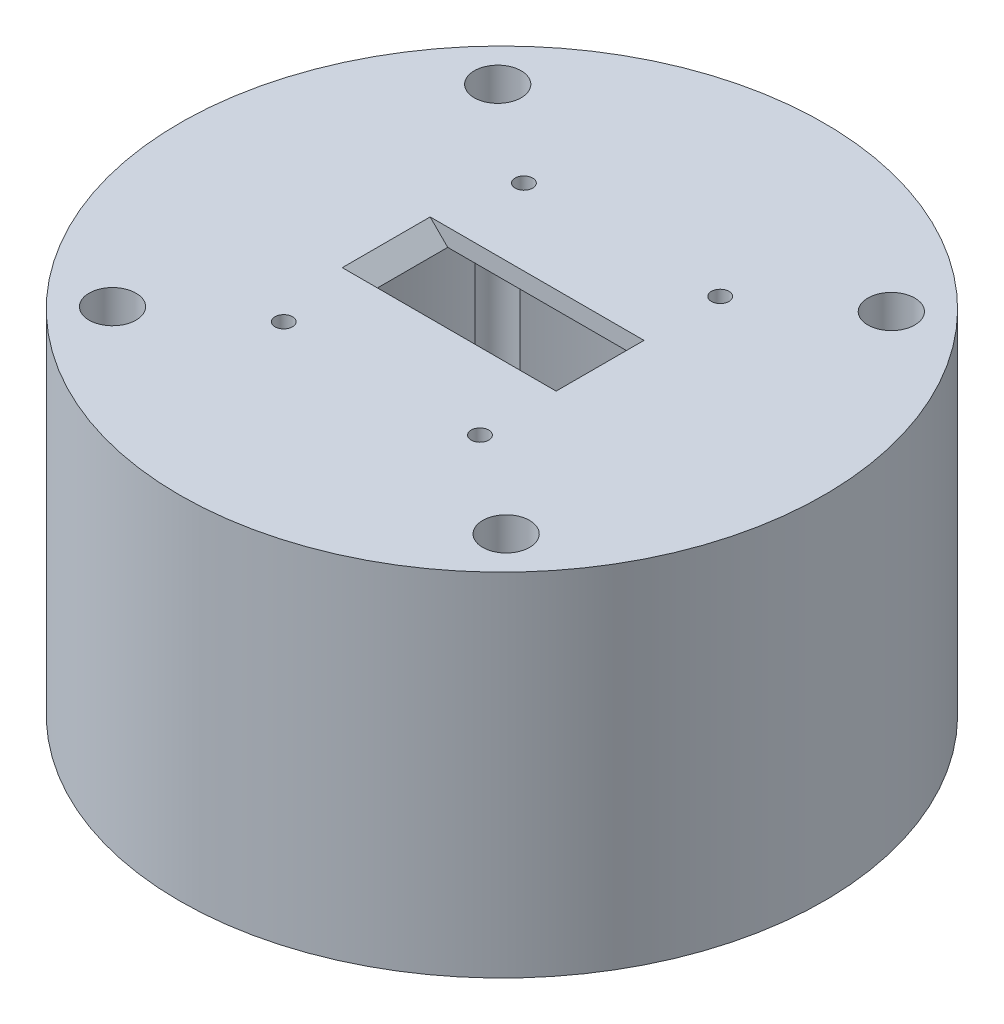
ISO-10303-21;
HEADER;
FILE_DESCRIPTION(('STEP AP214'),'2;1');
FILE_NAME('part.step','',(''),(''),'','','');
FILE_SCHEMA(('AUTOMOTIVE_DESIGN { 1 0 10303 214 1 1 1 1 }'));
ENDSEC;
DATA;
#1=APPLICATION_CONTEXT('core data for automotive mechanical design processes');
#2=APPLICATION_PROTOCOL_DEFINITION('international standard','automotive_design',2000,#1);
#3=PRODUCT_CONTEXT('',#1,'mechanical');
#4=PRODUCT('Part','Part','',(#3));
#5=PRODUCT_RELATED_PRODUCT_CATEGORY('part','',(#4));
#6=PRODUCT_DEFINITION_FORMATION('','',#4);
#7=PRODUCT_DEFINITION_CONTEXT('part definition',#1,'design');
#8=PRODUCT_DEFINITION('design','',#6,#7);
#9=PRODUCT_DEFINITION_SHAPE('','',#8);
#10=(LENGTH_UNIT() NAMED_UNIT(*) SI_UNIT(.MILLI.,.METRE.));
#11=(NAMED_UNIT(*) PLANE_ANGLE_UNIT() SI_UNIT($,.RADIAN.));
#12=(NAMED_UNIT(*) SI_UNIT($,.STERADIAN.) SOLID_ANGLE_UNIT());
#13=UNCERTAINTY_MEASURE_WITH_UNIT(LENGTH_MEASURE(1.E-05),#10,'distance_accuracy_value','');
#14=(GEOMETRIC_REPRESENTATION_CONTEXT(3) GLOBAL_UNCERTAINTY_ASSIGNED_CONTEXT((#13)) GLOBAL_UNIT_ASSIGNED_CONTEXT((#10,
#11,#12)) REPRESENTATION_CONTEXT('',''));
#15=CARTESIAN_POINT('',(0.,0.,0.));
#16=DIRECTION('',(0.,0.,1.));
#17=DIRECTION('',(1.,0.,0.));
#18=AXIS2_PLACEMENT_3D('',#15,#16,#17);
#19=CARTESIAN_POINT('',(16.75,60.,-7.5));
#20=DIRECTION('',(1.,0.,0.));
#21=DIRECTION('',(0.,0.,-1.));
#22=AXIS2_PLACEMENT_3D('',#19,#20,#21);
#23=PLANE('',#22);
#24=DIRECTION('',(0.,0.,-1.));
#25=VECTOR('',#24,1.);
#26=CARTESIAN_POINT('',(16.75,57.,-7.5));
#27=LINE('',#26,#25);
#28=CARTESIAN_POINT('',(16.75,57.,7.5));
#29=VERTEX_POINT('',#28);
#30=CARTESIAN_POINT('',(16.75,57.,-7.5));
#31=VERTEX_POINT('',#30);
#32=EDGE_CURVE('E276',#29,#31,#27,.T.);
#33=ORIENTED_EDGE('',*,*,#32,.F.);
#34=DIRECTION('',(0.,-1.,0.));
#35=VECTOR('',#34,1.);
#36=CARTESIAN_POINT('',(16.75,60.,7.5));
#37=LINE('',#36,#35);
#38=CARTESIAN_POINT('',(16.75,60.,7.5));
#39=VERTEX_POINT('',#38);
#40=EDGE_CURVE('E342',#39,#29,#37,.T.);
#41=ORIENTED_EDGE('',*,*,#40,.F.);
#42=DIRECTION('',(0.,0.,1.));
#43=VECTOR('',#42,1.);
#44=CARTESIAN_POINT('',(16.75,60.,-7.5));
#45=LINE('',#44,#43);
#46=CARTESIAN_POINT('',(16.75,60.,-7.5));
#47=VERTEX_POINT('',#46);
#48=EDGE_CURVE('E338',#47,#39,#45,.T.);
#49=ORIENTED_EDGE('',*,*,#48,.F.);
#50=DIRECTION('',(0.,-1.,0.));
#51=VECTOR('',#50,1.);
#52=CARTESIAN_POINT('',(16.75,60.,-7.5));
#53=LINE('',#52,#51);
#54=EDGE_CURVE('E343',#47,#31,#53,.T.);
#55=ORIENTED_EDGE('',*,*,#54,.T.);
#56=EDGE_LOOP('',(#33,#41,#49,#55));
#57=FACE_BOUND('',#56,.T.);
#58=ADVANCED_FACE('F46',(#57),#23,.F.);
#59=CARTESIAN_POINT('',(-16.75,60.,-7.5));
#60=DIRECTION('',(0.,0.,-1.));
#61=DIRECTION('',(-1.,0.,0.));
#62=AXIS2_PLACEMENT_3D('',#59,#60,#61);
#63=PLANE('',#62);
#64=DIRECTION('',(-1.,0.,0.));
#65=VECTOR('',#64,1.);
#66=CARTESIAN_POINT('',(-16.75,57.,-7.5));
#67=LINE('',#66,#65);
#68=CARTESIAN_POINT('',(-16.75,57.,-7.5));
#69=VERTEX_POINT('',#68);
#70=EDGE_CURVE('E273',#31,#69,#67,.T.);
#71=ORIENTED_EDGE('',*,*,#70,.F.);
#72=ORIENTED_EDGE('',*,*,#54,.F.);
#73=DIRECTION('',(1.,0.,0.));
#74=VECTOR('',#73,1.);
#75=CARTESIAN_POINT('',(-16.75,60.,-7.5));
#76=LINE('',#75,#74);
#77=CARTESIAN_POINT('',(-19.75,60.,-7.5));
#78=VERTEX_POINT('',#77);
#79=EDGE_CURVE('E61',#78,#47,#76,.T.);
#80=ORIENTED_EDGE('',*,*,#79,.F.);
#81=DIRECTION('',(0.707106781186546,-0.707106781186549,0.));
#82=VECTOR('',#81,1.);
#83=CARTESIAN_POINT('',(-18.25,58.5,-7.5));
#84=LINE('',#83,#82);
#85=EDGE_CURVE('E54',#78,#69,#84,.T.);
#86=ORIENTED_EDGE('',*,*,#85,.T.);
#87=EDGE_LOOP('',(#71,#72,#80,#86));
#88=FACE_BOUND('',#87,.T.);
#89=ADVANCED_FACE('F376',(#88),#63,.F.);
#90=CARTESIAN_POINT('',(-16.75,60.,7.5));
#91=DIRECTION('',(0.,0.,1.));
#92=DIRECTION('',(1.,0.,0.));
#93=AXIS2_PLACEMENT_3D('',#90,#91,#92);
#94=PLANE('',#93);
#95=DIRECTION('',(1.,0.,0.));
#96=VECTOR('',#95,1.);
#97=CARTESIAN_POINT('',(-16.75,57.,7.5));
#98=LINE('',#97,#96);
#99=CARTESIAN_POINT('',(-16.75,57.,7.5));
#100=VERTEX_POINT('',#99);
#101=EDGE_CURVE('E269',#100,#29,#98,.T.);
#102=ORIENTED_EDGE('',*,*,#101,.F.);
#103=DIRECTION('',(-0.707106781186546,0.707106781186549,0.));
#104=VECTOR('',#103,1.);
#105=CARTESIAN_POINT('',(-18.25,58.5,7.5));
#106=LINE('',#105,#104);
#107=CARTESIAN_POINT('',(-19.75,60.,7.5));
#108=VERTEX_POINT('',#107);
#109=EDGE_CURVE('E13',#100,#108,#106,.T.);
#110=ORIENTED_EDGE('',*,*,#109,.T.);
#111=DIRECTION('',(-1.,0.,0.));
#112=VECTOR('',#111,1.);
#113=CARTESIAN_POINT('',(-16.75,60.,7.5));
#114=LINE('',#113,#112);
#115=EDGE_CURVE('E69',#39,#108,#114,.T.);
#116=ORIENTED_EDGE('',*,*,#115,.F.);
#117=ORIENTED_EDGE('',*,*,#40,.T.);
#118=EDGE_LOOP('',(#102,#110,#116,#117));
#119=FACE_BOUND('',#118,.T.);
#120=ADVANCED_FACE('F384',(#119),#94,.F.);
#121=CARTESIAN_POINT('',(-16.75,0.,-20.5));
#122=DIRECTION('',(0.,1.,0.));
#123=DIRECTION('',(0.,0.,1.));
#124=AXIS2_PLACEMENT_3D('',#121,#122,#123);
#125=CYLINDRICAL_SURFACE('',#124,1.5);
#126=CARTESIAN_POINT('',(-16.75,60.,-20.5));
#127=DIRECTION('',(0.,1.,0.));
#128=DIRECTION('',(0.,0.,1.));
#129=AXIS2_PLACEMENT_3D('',#126,#127,#128);
#130=CIRCLE('',#129,1.5);
#131=CARTESIAN_POINT('',(-16.75,60.,-19.));
#132=VERTEX_POINT('',#131);
#133=EDGE_CURVE('E335',#132,#132,#130,.T.);
#134=ORIENTED_EDGE('',*,*,#133,.T.);
#135=EDGE_LOOP('',(#134));
#136=FACE_BOUND('',#135,.T.);
#137=CARTESIAN_POINT('',(-16.75,57.,-20.5));
#138=DIRECTION('',(0.,-1.,0.));
#139=DIRECTION('',(0.,0.,-1.));
#140=AXIS2_PLACEMENT_3D('',#137,#138,#139);
#141=CIRCLE('',#140,1.5);
#142=CARTESIAN_POINT('',(-16.75,57.,-22.));
#143=VERTEX_POINT('',#142);
#144=EDGE_CURVE('E266',#143,#143,#141,.F.);
#145=ORIENTED_EDGE('',*,*,#144,.F.);
#146=EDGE_LOOP('',(#145));
#147=FACE_BOUND('',#146,.T.);
#148=ADVANCED_FACE('F473',(#136,#147),#125,.F.);
#149=CARTESIAN_POINT('',(16.75,0.,-20.5));
#150=DIRECTION('',(0.,1.,0.));
#151=DIRECTION('',(0.,0.,1.));
#152=AXIS2_PLACEMENT_3D('',#149,#150,#151);
#153=CYLINDRICAL_SURFACE('',#152,1.5);
#154=CARTESIAN_POINT('',(16.75,60.,-20.5));
#155=DIRECTION('',(0.,1.,0.));
#156=DIRECTION('',(0.,0.,1.));
#157=AXIS2_PLACEMENT_3D('',#154,#155,#156);
#158=CIRCLE('',#157,1.5);
#159=CARTESIAN_POINT('',(16.75,60.,-19.));
#160=VERTEX_POINT('',#159);
#161=EDGE_CURVE('E303',#160,#160,#158,.T.);
#162=ORIENTED_EDGE('',*,*,#161,.T.);
#163=EDGE_LOOP('',(#162));
#164=FACE_BOUND('',#163,.T.);
#165=CARTESIAN_POINT('',(16.75,57.,-20.5));
#166=DIRECTION('',(0.,-1.,0.));
#167=DIRECTION('',(0.,0.,-1.));
#168=AXIS2_PLACEMENT_3D('',#165,#166,#167);
#169=CIRCLE('',#168,1.5);
#170=CARTESIAN_POINT('',(16.75,57.,-22.));
#171=VERTEX_POINT('',#170);
#172=EDGE_CURVE('E263',#171,#171,#169,.F.);
#173=ORIENTED_EDGE('',*,*,#172,.F.);
#174=EDGE_LOOP('',(#173));
#175=FACE_BOUND('',#174,.T.);
#176=ADVANCED_FACE('F469',(#164,#175),#153,.F.);
#177=CARTESIAN_POINT('',(-16.75,0.,20.5));
#178=DIRECTION('',(0.,1.,0.));
#179=DIRECTION('',(0.,0.,1.));
#180=AXIS2_PLACEMENT_3D('',#177,#178,#179);
#181=CYLINDRICAL_SURFACE('',#180,1.5);
#182=CARTESIAN_POINT('',(-16.75,60.,20.5));
#183=DIRECTION('',(0.,1.,0.));
#184=DIRECTION('',(0.,0.,1.));
#185=AXIS2_PLACEMENT_3D('',#182,#183,#184);
#186=CIRCLE('',#185,1.5);
#187=CARTESIAN_POINT('',(-16.75,60.,22.));
#188=VERTEX_POINT('',#187);
#189=EDGE_CURVE('E307',#188,#188,#186,.T.);
#190=ORIENTED_EDGE('',*,*,#189,.T.);
#191=EDGE_LOOP('',(#190));
#192=FACE_BOUND('',#191,.T.);
#193=CARTESIAN_POINT('',(-16.75,57.,20.5));
#194=DIRECTION('',(0.,-1.,0.));
#195=DIRECTION('',(0.,0.,-1.));
#196=AXIS2_PLACEMENT_3D('',#193,#194,#195);
#197=CIRCLE('',#196,1.5);
#198=CARTESIAN_POINT('',(-16.75,57.,19.));
#199=VERTEX_POINT('',#198);
#200=EDGE_CURVE('E260',#199,#199,#197,.F.);
#201=ORIENTED_EDGE('',*,*,#200,.F.);
#202=EDGE_LOOP('',(#201));
#203=FACE_BOUND('',#202,.T.);
#204=ADVANCED_FACE('F472',(#192,#203),#181,.F.);
#205=CARTESIAN_POINT('',(16.75,0.,20.5));
#206=DIRECTION('',(0.,1.,0.));
#207=DIRECTION('',(0.,0.,1.));
#208=AXIS2_PLACEMENT_3D('',#205,#206,#207);
#209=CYLINDRICAL_SURFACE('',#208,1.5);
#210=CARTESIAN_POINT('',(16.75,60.,20.5));
#211=DIRECTION('',(0.,1.,0.));
#212=DIRECTION('',(0.,0.,1.));
#213=AXIS2_PLACEMENT_3D('',#210,#211,#212);
#214=CIRCLE('',#213,1.5);
#215=CARTESIAN_POINT('',(16.75,60.,22.));
#216=VERTEX_POINT('',#215);
#217=EDGE_CURVE('E282',#216,#216,#214,.T.);
#218=ORIENTED_EDGE('',*,*,#217,.T.);
#219=EDGE_LOOP('',(#218));
#220=FACE_BOUND('',#219,.T.);
#221=CARTESIAN_POINT('',(16.75,57.,20.5));
#222=DIRECTION('',(0.,-1.,0.));
#223=DIRECTION('',(0.,0.,-1.));
#224=AXIS2_PLACEMENT_3D('',#221,#222,#223);
#225=CIRCLE('',#224,1.5);
#226=CARTESIAN_POINT('',(16.75,57.,19.));
#227=VERTEX_POINT('',#226);
#228=EDGE_CURVE('E248',#227,#227,#225,.F.);
#229=ORIENTED_EDGE('',*,*,#228,.F.);
#230=EDGE_LOOP('',(#229));
#231=FACE_BOUND('',#230,.T.);
#232=ADVANCED_FACE('F477',(#220,#231),#209,.F.);
#233=CARTESIAN_POINT('',(0.,50.,0.));
#234=DIRECTION('',(0.,-1.,0.));
#235=DIRECTION('',(0.,0.,-1.));
#236=AXIS2_PLACEMENT_3D('',#233,#234,#235);
#237=CYLINDRICAL_SURFACE('',#236,50.);
#238=CARTESIAN_POINT('',(0.,50.,0.));
#239=DIRECTION('',(0.,-1.,0.));
#240=DIRECTION('',(0.,0.,-1.));
#241=AXIS2_PLACEMENT_3D('',#238,#239,#240);
#242=CIRCLE('',#241,50.);
#243=CARTESIAN_POINT('',(37.590562846943,50.,-32.9689184664895));
#244=VERTEX_POINT('',#243);
#245=CARTESIAN_POINT('',(37.590562846943,50.,32.9689184664894));
#246=VERTEX_POINT('',#245);
#247=EDGE_CURVE('E354',#244,#246,#242,.T.);
#248=ORIENTED_EDGE('',*,*,#247,.F.);
#249=DIRECTION('',(0.,1.,0.));
#250=VECTOR('',#249,1.);
#251=CARTESIAN_POINT('',(37.5905628469429,30.,-32.9689184664895));
#252=LINE('',#251,#250);
#253=CARTESIAN_POINT('',(37.5905628469429,0.,-32.9689184664896));
#254=VERTEX_POINT('',#253);
#255=EDGE_CURVE('E332',#244,#254,#252,.F.);
#256=ORIENTED_EDGE('',*,*,#255,.T.);
#257=CARTESIAN_POINT('',(0.,0.,0.));
#258=DIRECTION('',(0.,-1.,0.));
#259=DIRECTION('',(0.,0.,-1.));
#260=AXIS2_PLACEMENT_3D('',#257,#258,#259);
#261=CIRCLE('',#260,50.);
#262=CARTESIAN_POINT('',(37.5905628469429,0.,32.9689184664895));
#263=VERTEX_POINT('',#262);
#264=EDGE_CURVE('E353',#254,#263,#261,.T.);
#265=ORIENTED_EDGE('',*,*,#264,.T.);
#266=DIRECTION('',(0.,1.,0.));
#267=VECTOR('',#266,1.);
#268=CARTESIAN_POINT('',(37.5905628469429,30.,32.9689184664894));
#269=LINE('',#268,#267);
#270=EDGE_CURVE('E306',#263,#246,#269,.T.);
#271=ORIENTED_EDGE('',*,*,#270,.T.);
#272=EDGE_LOOP('',(#248,#256,#265,#271));
#273=FACE_BOUND('',#272,.T.);
#274=ADVANCED_FACE('F411',(#273),#237,.F.);
#275=CARTESIAN_POINT('',(-33.7747495446768,0.,-36.868228777558));
#276=VERTEX_POINT('',#275);
#277=CARTESIAN_POINT('',(33.7747495446768,0.,-36.868228777558));
#278=VERTEX_POINT('',#277);
#279=EDGE_CURVE('E346',#276,#278,#261,.T.);
#280=ORIENTED_EDGE('',*,*,#279,.T.);
#281=DIRECTION('',(0.,1.,0.));
#282=VECTOR('',#281,1.);
#283=CARTESIAN_POINT('',(33.7747495446767,30.,-36.868228777558));
#284=LINE('',#283,#282);
#285=CARTESIAN_POINT('',(33.7747495446767,50.,-36.8682287775581));
#286=VERTEX_POINT('',#285);
#287=EDGE_CURVE('E329',#278,#286,#284,.T.);
#288=ORIENTED_EDGE('',*,*,#287,.T.);
#289=CARTESIAN_POINT('',(-33.7747495446767,50.,-36.8682287775581));
#290=VERTEX_POINT('',#289);
#291=EDGE_CURVE('E349',#290,#286,#242,.T.);
#292=ORIENTED_EDGE('',*,*,#291,.F.);
#293=DIRECTION('',(0.,1.,0.));
#294=VECTOR('',#293,1.);
#295=CARTESIAN_POINT('',(-33.7747495446767,30.,-36.868228777558));
#296=LINE('',#295,#294);
#297=EDGE_CURVE('E326',#290,#276,#296,.F.);
#298=ORIENTED_EDGE('',*,*,#297,.T.);
#299=EDGE_LOOP('',(#280,#288,#292,#298));
#300=FACE_BOUND('',#299,.T.);
#301=ADVANCED_FACE('F454',(#300),#237,.F.);
#302=CARTESIAN_POINT('',(-37.5905628469429,0.,32.9689184664895));
#303=VERTEX_POINT('',#302);
#304=CARTESIAN_POINT('',(-37.5905628469429,0.,-32.9689184664895));
#305=VERTEX_POINT('',#304);
#306=EDGE_CURVE('E357',#303,#305,#261,.T.);
#307=ORIENTED_EDGE('',*,*,#306,.T.);
#308=DIRECTION('',(0.,1.,0.));
#309=VECTOR('',#308,1.);
#310=CARTESIAN_POINT('',(-37.5905628469429,30.,-32.9689184664894));
#311=LINE('',#310,#309);
#312=CARTESIAN_POINT('',(-37.590562846943,50.,-32.9689184664894));
#313=VERTEX_POINT('',#312);
#314=EDGE_CURVE('E323',#305,#313,#311,.T.);
#315=ORIENTED_EDGE('',*,*,#314,.T.);
#316=CARTESIAN_POINT('',(-37.590562846943,50.,32.9689184664894));
#317=VERTEX_POINT('',#316);
#318=EDGE_CURVE('E352',#317,#313,#242,.T.);
#319=ORIENTED_EDGE('',*,*,#318,.F.);
#320=DIRECTION('',(0.,1.,0.));
#321=VECTOR('',#320,1.);
#322=CARTESIAN_POINT('',(-37.5905628469429,30.,32.9689184664894));
#323=LINE('',#322,#321);
#324=EDGE_CURVE('E320',#317,#303,#323,.F.);
#325=ORIENTED_EDGE('',*,*,#324,.T.);
#326=EDGE_LOOP('',(#307,#315,#319,#325));
#327=FACE_BOUND('',#326,.T.);
#328=ADVANCED_FACE('F398',(#327),#237,.F.);
#329=CARTESIAN_POINT('',(0.,60.,0.));
#330=DIRECTION('',(0.,-1.,0.));
#331=DIRECTION('',(0.,0.,-1.));
#332=AXIS2_PLACEMENT_3D('',#329,#330,#331);
#333=CYLINDRICAL_SURFACE('',#332,55.);
#334=CARTESIAN_POINT('',(0.,60.,0.));
#335=DIRECTION('',(0.,1.,0.));
#336=DIRECTION('',(0.,0.,1.));
#337=AXIS2_PLACEMENT_3D('',#334,#335,#336);
#338=CIRCLE('',#337,55.);
#339=CARTESIAN_POINT('',(0.,60.,55.));
#340=VERTEX_POINT('',#339);
#341=EDGE_CURVE('E358',#340,#340,#338,.T.);
#342=ORIENTED_EDGE('',*,*,#341,.F.);
#343=EDGE_LOOP('',(#342));
#344=FACE_BOUND('',#343,.T.);
#345=CARTESIAN_POINT('',(0.,0.,0.));
#346=DIRECTION('',(0.,1.,0.));
#347=DIRECTION('',(0.,0.,1.));
#348=AXIS2_PLACEMENT_3D('',#345,#346,#347);
#349=CIRCLE('',#348,55.);
#350=CARTESIAN_POINT('',(0.,0.,55.));
#351=VERTEX_POINT('',#350);
#352=EDGE_CURVE('E362',#351,#351,#349,.T.);
#353=ORIENTED_EDGE('',*,*,#352,.T.);
#354=EDGE_LOOP('',(#353));
#355=FACE_BOUND('',#354,.T.);
#356=ADVANCED_FACE('F391',(#344,#355),#333,.T.);
#357=CARTESIAN_POINT('',(0.,60.,0.));
#358=DIRECTION('',(0.,1.,0.));
#359=DIRECTION('',(0.,0.,1.));
#360=AXIS2_PLACEMENT_3D('',#357,#358,#359);
#361=PLANE('',#360);
#362=CARTESIAN_POINT('',(33.5917270558466,60.,-32.8724181253145));
#363=DIRECTION('',(0.,1.,0.));
#364=DIRECTION('',(0.,0.,1.));
#365=AXIS2_PLACEMENT_3D('',#362,#363,#364);
#366=CIRCLE('',#365,4.);
#367=CARTESIAN_POINT('',(33.5917270558466,60.,-28.8724181253145));
#368=VERTEX_POINT('',#367);
#369=EDGE_CURVE('E278',#368,#368,#366,.T.);
#370=ORIENTED_EDGE('',*,*,#369,.F.);
#371=EDGE_LOOP('',(#370));
#372=FACE_BOUND('',#371,.T.);
#373=CARTESIAN_POINT('',(-33.5917270558466,60.,-32.8724181253145));
#374=DIRECTION('',(0.,1.,0.));
#375=DIRECTION('',(0.,0.,1.));
#376=AXIS2_PLACEMENT_3D('',#373,#374,#375);
#377=CIRCLE('',#376,4.);
#378=CARTESIAN_POINT('',(-33.5917270558466,60.,-28.8724181253145));
#379=VERTEX_POINT('',#378);
#380=EDGE_CURVE('E295',#379,#379,#377,.T.);
#381=ORIENTED_EDGE('',*,*,#380,.F.);
#382=EDGE_LOOP('',(#381));
#383=FACE_BOUND('',#382,.T.);
#384=CARTESIAN_POINT('',(-33.5917270558466,60.,32.8724181253145));
#385=DIRECTION('',(0.,1.,0.));
#386=DIRECTION('',(0.,0.,1.));
#387=AXIS2_PLACEMENT_3D('',#384,#385,#386);
#388=CIRCLE('',#387,4.);
#389=CARTESIAN_POINT('',(-33.5917270558466,60.,36.8724181253145));
#390=VERTEX_POINT('',#389);
#391=EDGE_CURVE('E289',#390,#390,#388,.T.);
#392=ORIENTED_EDGE('',*,*,#391,.F.);
#393=EDGE_LOOP('',(#392));
#394=FACE_BOUND('',#393,.T.);
#395=CARTESIAN_POINT('',(33.5917270558466,60.,32.8724181253145));
#396=DIRECTION('',(0.,1.,0.));
#397=DIRECTION('',(0.,0.,1.));
#398=AXIS2_PLACEMENT_3D('',#395,#396,#397);
#399=CIRCLE('',#398,4.00000000000001);
#400=CARTESIAN_POINT('',(33.5917270558466,60.,36.8724181253145));
#401=VERTEX_POINT('',#400);
#402=EDGE_CURVE('E283',#401,#401,#399,.T.);
#403=ORIENTED_EDGE('',*,*,#402,.F.);
#404=EDGE_LOOP('',(#403));
#405=FACE_BOUND('',#404,.T.);
#406=ORIENTED_EDGE('',*,*,#217,.F.);
#407=EDGE_LOOP('',(#406));
#408=FACE_BOUND('',#407,.T.);
#409=ORIENTED_EDGE('',*,*,#189,.F.);
#410=EDGE_LOOP('',(#409));
#411=FACE_BOUND('',#410,.T.);
#412=ORIENTED_EDGE('',*,*,#161,.F.);
#413=EDGE_LOOP('',(#412));
#414=FACE_BOUND('',#413,.T.);
#415=ORIENTED_EDGE('',*,*,#133,.F.);
#416=EDGE_LOOP('',(#415));
#417=FACE_BOUND('',#416,.T.);
#418=DIRECTION('',(0.,0.,-1.));
#419=VECTOR('',#418,1.);
#420=CARTESIAN_POINT('',(-19.75,60.,-7.5));
#421=LINE('',#420,#419);
#422=EDGE_CURVE('E372',#108,#78,#421,.T.);
#423=ORIENTED_EDGE('',*,*,#422,.T.);
#424=ORIENTED_EDGE('',*,*,#79,.T.);
#425=ORIENTED_EDGE('',*,*,#48,.T.);
#426=ORIENTED_EDGE('',*,*,#115,.T.);
#427=EDGE_LOOP('',(#423,#424,#425,#426));
#428=FACE_BOUND('',#427,.T.);
#429=ORIENTED_EDGE('',*,*,#341,.T.);
#430=EDGE_LOOP('',(#429));
#431=FACE_BOUND('',#430,.T.);
#432=ADVANCED_FACE('F387',(#372,#383,#394,#405,#408,#411,#414,#417,#428,#431),#361,.T.);
#433=CARTESIAN_POINT('',(0.,0.,0.));
#434=DIRECTION('',(0.,1.,0.));
#435=DIRECTION('',(0.,0.,1.));
#436=AXIS2_PLACEMENT_3D('',#433,#434,#435);
#437=PLANE('',#436);
#438=ORIENTED_EDGE('',*,*,#264,.F.);
#439=CARTESIAN_POINT('',(33.5917270558466,0.,-32.8724181253145));
#440=DIRECTION('',(0.,1.,0.));
#441=DIRECTION('',(0.,0.,1.));
#442=AXIS2_PLACEMENT_3D('',#439,#440,#441);
#443=CIRCLE('',#442,4.);
#444=EDGE_CURVE('E298',#254,#278,#443,.T.);
#445=ORIENTED_EDGE('',*,*,#444,.T.);
#446=ORIENTED_EDGE('',*,*,#279,.F.);
#447=CARTESIAN_POINT('',(-33.5917270558466,0.,-32.8724181253145));
#448=DIRECTION('',(0.,1.,0.));
#449=DIRECTION('',(0.,0.,1.));
#450=AXIS2_PLACEMENT_3D('',#447,#448,#449);
#451=CIRCLE('',#450,4.);
#452=EDGE_CURVE('E292',#276,#305,#451,.T.);
#453=ORIENTED_EDGE('',*,*,#452,.T.);
#454=ORIENTED_EDGE('',*,*,#306,.F.);
#455=CARTESIAN_POINT('',(-33.5917270558466,0.,32.8724181253145));
#456=DIRECTION('',(0.,1.,0.));
#457=DIRECTION('',(0.,0.,1.));
#458=AXIS2_PLACEMENT_3D('',#455,#456,#457);
#459=CIRCLE('',#458,4.);
#460=CARTESIAN_POINT('',(-33.7747495446768,0.,36.868228777558));
#461=VERTEX_POINT('',#460);
#462=EDGE_CURVE('E286',#303,#461,#459,.T.);
#463=ORIENTED_EDGE('',*,*,#462,.T.);
#464=CARTESIAN_POINT('',(33.7747495446768,0.,36.868228777558));
#465=VERTEX_POINT('',#464);
#466=EDGE_CURVE('E700',#465,#461,#261,.T.);
#467=ORIENTED_EDGE('',*,*,#466,.F.);
#468=CARTESIAN_POINT('',(33.5917270558466,0.,32.8724181253145));
#469=DIRECTION('',(0.,1.,0.));
#470=DIRECTION('',(0.,0.,1.));
#471=AXIS2_PLACEMENT_3D('',#468,#469,#470);
#472=CIRCLE('',#471,4.00000000000001);
#473=EDGE_CURVE('E279',#465,#263,#472,.T.);
#474=ORIENTED_EDGE('',*,*,#473,.T.);
#475=EDGE_LOOP('',(#438,#445,#446,#453,#454,#463,#467,#474));
#476=FACE_BOUND('',#475,.T.);
#477=ORIENTED_EDGE('',*,*,#352,.F.);
#478=EDGE_LOOP('',(#477));
#479=FACE_BOUND('',#478,.T.);
#480=ADVANCED_FACE('F390',(#476,#479),#437,.F.);
#481=ORIENTED_EDGE('',*,*,#466,.T.);
#482=DIRECTION('',(0.,1.,0.));
#483=VECTOR('',#482,1.);
#484=CARTESIAN_POINT('',(-33.7747495446767,30.,36.868228777558));
#485=LINE('',#484,#483);
#486=CARTESIAN_POINT('',(-33.7747495446767,50.,36.8682287775581));
#487=VERTEX_POINT('',#486);
#488=EDGE_CURVE('E317',#461,#487,#485,.T.);
#489=ORIENTED_EDGE('',*,*,#488,.T.);
#490=CARTESIAN_POINT('',(33.7747495446767,50.,36.8682287775581));
#491=VERTEX_POINT('',#490);
#492=EDGE_CURVE('E441',#491,#487,#242,.T.);
#493=ORIENTED_EDGE('',*,*,#492,.F.);
#494=DIRECTION('',(0.,1.,0.));
#495=VECTOR('',#494,1.);
#496=CARTESIAN_POINT('',(33.7747495446767,30.,36.868228777558));
#497=LINE('',#496,#495);
#498=EDGE_CURVE('E314',#491,#465,#497,.F.);
#499=ORIENTED_EDGE('',*,*,#498,.T.);
#500=EDGE_LOOP('',(#481,#489,#493,#499));
#501=FACE_BOUND('',#500,.T.);
#502=ADVANCED_FACE('F402',(#501),#237,.F.);
#503=CARTESIAN_POINT('',(0.,50.,0.));
#504=DIRECTION('',(0.,-1.,0.));
#505=DIRECTION('',(0.,0.,-1.));
#506=AXIS2_PLACEMENT_3D('',#503,#504,#505);
#507=PLANE('',#506);
#508=CARTESIAN_POINT('',(22.5,50.,22.5));
#509=DIRECTION('',(0.,-1.,0.));
#510=DIRECTION('',(0.,0.,-1.));
#511=AXIS2_PLACEMENT_3D('',#508,#509,#510);
#512=CIRCLE('',#511,10.);
#513=CARTESIAN_POINT('',(32.5,50.,22.5));
#514=VERTEX_POINT('',#513);
#515=CARTESIAN_POINT('',(22.5,50.,32.5));
#516=VERTEX_POINT('',#515);
#517=EDGE_CURVE('E191',#514,#516,#512,.T.);
#518=ORIENTED_EDGE('',*,*,#517,.F.);
#519=DIRECTION('',(0.,0.,1.));
#520=VECTOR('',#519,1.);
#521=CARTESIAN_POINT('',(32.5,50.,-22.5));
#522=LINE('',#521,#520);
#523=CARTESIAN_POINT('',(32.5,50.,-22.5));
#524=VERTEX_POINT('',#523);
#525=EDGE_CURVE('E210',#524,#514,#522,.T.);
#526=ORIENTED_EDGE('',*,*,#525,.F.);
#527=CARTESIAN_POINT('',(22.5,50.,-22.5));
#528=DIRECTION('',(0.,-1.,0.));
#529=DIRECTION('',(0.,0.,1.));
#530=AXIS2_PLACEMENT_3D('',#527,#528,#529);
#531=CIRCLE('',#530,10.);
#532=CARTESIAN_POINT('',(22.5,50.,-32.5));
#533=VERTEX_POINT('',#532);
#534=EDGE_CURVE('E213',#533,#524,#531,.T.);
#535=ORIENTED_EDGE('',*,*,#534,.F.);
#536=DIRECTION('',(1.,0.,0.));
#537=VECTOR('',#536,1.);
#538=CARTESIAN_POINT('',(-22.5,50.,-32.5));
#539=LINE('',#538,#537);
#540=CARTESIAN_POINT('',(-22.5,50.,-32.5));
#541=VERTEX_POINT('',#540);
#542=EDGE_CURVE('E241',#541,#533,#539,.T.);
#543=ORIENTED_EDGE('',*,*,#542,.F.);
#544=CARTESIAN_POINT('',(-22.5,50.,-22.5));
#545=DIRECTION('',(0.,-1.,0.));
#546=DIRECTION('',(0.,0.,-1.));
#547=AXIS2_PLACEMENT_3D('',#544,#545,#546);
#548=CIRCLE('',#547,10.);
#549=CARTESIAN_POINT('',(-32.5,50.,-22.5));
#550=VERTEX_POINT('',#549);
#551=EDGE_CURVE('E238',#550,#541,#548,.T.);
#552=ORIENTED_EDGE('',*,*,#551,.F.);
#553=DIRECTION('',(0.,0.,-1.));
#554=VECTOR('',#553,1.);
#555=CARTESIAN_POINT('',(-32.5,50.,-22.5));
#556=LINE('',#555,#554);
#557=CARTESIAN_POINT('',(-32.5,50.,22.5));
#558=VERTEX_POINT('',#557);
#559=EDGE_CURVE('E235',#558,#550,#556,.T.);
#560=ORIENTED_EDGE('',*,*,#559,.F.);
#561=CARTESIAN_POINT('',(-22.5,50.,22.5));
#562=DIRECTION('',(0.,-1.,0.));
#563=DIRECTION('',(0.,0.,1.));
#564=AXIS2_PLACEMENT_3D('',#561,#562,#563);
#565=CIRCLE('',#564,10.);
#566=CARTESIAN_POINT('',(-22.5,50.,32.5));
#567=VERTEX_POINT('',#566);
#568=EDGE_CURVE('E232',#567,#558,#565,.T.);
#569=ORIENTED_EDGE('',*,*,#568,.F.);
#570=DIRECTION('',(-1.,0.,0.));
#571=VECTOR('',#570,1.);
#572=CARTESIAN_POINT('',(-22.5,50.,32.5));
#573=LINE('',#572,#571);
#574=EDGE_CURVE('E230',#516,#567,#573,.T.);
#575=ORIENTED_EDGE('',*,*,#574,.F.);
#576=EDGE_LOOP('',(#518,#526,#535,#543,#552,#560,#569,#575));
#577=FACE_BOUND('',#576,.T.);
#578=CARTESIAN_POINT('',(33.5917270558466,50.,-32.8724181253145));
#579=DIRECTION('',(0.,-1.,0.));
#580=DIRECTION('',(0.,0.,-1.));
#581=AXIS2_PLACEMENT_3D('',#578,#579,#580);
#582=CIRCLE('',#581,4.);
#583=EDGE_CURVE('E370',#244,#286,#582,.T.);
#584=ORIENTED_EDGE('',*,*,#583,.F.);
#585=ORIENTED_EDGE('',*,*,#247,.T.);
#586=CARTESIAN_POINT('',(33.5917270558466,50.,32.8724181253145));
#587=DIRECTION('',(0.,-1.,0.));
#588=DIRECTION('',(0.,0.,-1.));
#589=AXIS2_PLACEMENT_3D('',#586,#587,#588);
#590=CIRCLE('',#589,4.00000000000001);
#591=EDGE_CURVE('E361',#491,#246,#590,.T.);
#592=ORIENTED_EDGE('',*,*,#591,.F.);
#593=ORIENTED_EDGE('',*,*,#492,.T.);
#594=CARTESIAN_POINT('',(-33.5917270558466,50.,32.8724181253145));
#595=DIRECTION('',(0.,-1.,0.));
#596=DIRECTION('',(0.,0.,-1.));
#597=AXIS2_PLACEMENT_3D('',#594,#595,#596);
#598=CIRCLE('',#597,4.);
#599=EDGE_CURVE('E366',#317,#487,#598,.T.);
#600=ORIENTED_EDGE('',*,*,#599,.F.);
#601=ORIENTED_EDGE('',*,*,#318,.T.);
#602=CARTESIAN_POINT('',(-33.5917270558466,50.,-32.8724181253145));
#603=DIRECTION('',(0.,-1.,0.));
#604=DIRECTION('',(0.,0.,-1.));
#605=AXIS2_PLACEMENT_3D('',#602,#603,#604);
#606=CIRCLE('',#605,4.);
#607=EDGE_CURVE('E368',#290,#313,#606,.T.);
#608=ORIENTED_EDGE('',*,*,#607,.F.);
#609=ORIENTED_EDGE('',*,*,#291,.T.);
#610=EDGE_LOOP('',(#584,#585,#592,#593,#600,#601,#608,#609));
#611=FACE_BOUND('',#610,.T.);
#612=ADVANCED_FACE('F408',(#577,#611),#507,.T.);
#613=CARTESIAN_POINT('',(33.5917270558466,0.,32.8724181253145));
#614=DIRECTION('',(0.,1.,0.));
#615=DIRECTION('',(0.,0.,1.));
#616=AXIS2_PLACEMENT_3D('',#613,#614,#615);
#617=CYLINDRICAL_SURFACE('',#616,4.00000000000001);
#618=ORIENTED_EDGE('',*,*,#402,.T.);
#619=EDGE_LOOP('',(#618));
#620=FACE_BOUND('',#619,.T.);
#621=ORIENTED_EDGE('',*,*,#591,.T.);
#622=ORIENTED_EDGE('',*,*,#270,.F.);
#623=ORIENTED_EDGE('',*,*,#473,.F.);
#624=ORIENTED_EDGE('',*,*,#498,.F.);
#625=EDGE_LOOP('',(#621,#622,#623,#624));
#626=FACE_BOUND('',#625,.T.);
#627=ADVANCED_FACE('F422',(#620,#626),#617,.F.);
#628=CARTESIAN_POINT('',(-33.5917270558466,0.,32.8724181253145));
#629=DIRECTION('',(0.,1.,0.));
#630=DIRECTION('',(0.,0.,1.));
#631=AXIS2_PLACEMENT_3D('',#628,#629,#630);
#632=CYLINDRICAL_SURFACE('',#631,4.);
#633=ORIENTED_EDGE('',*,*,#391,.T.);
#634=EDGE_LOOP('',(#633));
#635=FACE_BOUND('',#634,.T.);
#636=ORIENTED_EDGE('',*,*,#599,.T.);
#637=ORIENTED_EDGE('',*,*,#488,.F.);
#638=ORIENTED_EDGE('',*,*,#462,.F.);
#639=ORIENTED_EDGE('',*,*,#324,.F.);
#640=EDGE_LOOP('',(#636,#637,#638,#639));
#641=FACE_BOUND('',#640,.T.);
#642=ADVANCED_FACE('F427',(#635,#641),#632,.F.);
#643=CARTESIAN_POINT('',(-33.5917270558466,0.,-32.8724181253145));
#644=DIRECTION('',(0.,1.,0.));
#645=DIRECTION('',(0.,0.,1.));
#646=AXIS2_PLACEMENT_3D('',#643,#644,#645);
#647=CYLINDRICAL_SURFACE('',#646,4.);
#648=ORIENTED_EDGE('',*,*,#380,.T.);
#649=EDGE_LOOP('',(#648));
#650=FACE_BOUND('',#649,.T.);
#651=ORIENTED_EDGE('',*,*,#607,.T.);
#652=ORIENTED_EDGE('',*,*,#314,.F.);
#653=ORIENTED_EDGE('',*,*,#452,.F.);
#654=ORIENTED_EDGE('',*,*,#297,.F.);
#655=EDGE_LOOP('',(#651,#652,#653,#654));
#656=FACE_BOUND('',#655,.T.);
#657=ADVANCED_FACE('F451',(#650,#656),#647,.F.);
#658=CARTESIAN_POINT('',(33.5917270558466,0.,-32.8724181253145));
#659=DIRECTION('',(0.,1.,0.));
#660=DIRECTION('',(0.,0.,1.));
#661=AXIS2_PLACEMENT_3D('',#658,#659,#660);
#662=CYLINDRICAL_SURFACE('',#661,4.);
#663=ORIENTED_EDGE('',*,*,#369,.T.);
#664=EDGE_LOOP('',(#663));
#665=FACE_BOUND('',#664,.T.);
#666=ORIENTED_EDGE('',*,*,#583,.T.);
#667=ORIENTED_EDGE('',*,*,#287,.F.);
#668=ORIENTED_EDGE('',*,*,#444,.F.);
#669=ORIENTED_EDGE('',*,*,#255,.F.);
#670=EDGE_LOOP('',(#666,#667,#668,#669));
#671=FACE_BOUND('',#670,.T.);
#672=ADVANCED_FACE('F455',(#665,#671),#662,.F.);
#673=CARTESIAN_POINT('',(22.5,57.,22.5));
#674=DIRECTION('',(0.,-1.,0.));
#675=DIRECTION('',(0.,0.,-1.));
#676=AXIS2_PLACEMENT_3D('',#673,#674,#675);
#677=PLANE('',#676);
#678=ORIENTED_EDGE('',*,*,#144,.T.);
#679=EDGE_LOOP('',(#678));
#680=FACE_BOUND('',#679,.T.);
#681=ORIENTED_EDGE('',*,*,#172,.T.);
#682=EDGE_LOOP('',(#681));
#683=FACE_BOUND('',#682,.T.);
#684=ORIENTED_EDGE('',*,*,#200,.T.);
#685=EDGE_LOOP('',(#684));
#686=FACE_BOUND('',#685,.T.);
#687=ORIENTED_EDGE('',*,*,#228,.T.);
#688=EDGE_LOOP('',(#687));
#689=FACE_BOUND('',#688,.T.);
#690=CARTESIAN_POINT('',(22.5,57.,22.5));
#691=DIRECTION('',(0.,-1.,0.));
#692=DIRECTION('',(0.,0.,-1.));
#693=AXIS2_PLACEMENT_3D('',#690,#691,#692);
#694=CIRCLE('',#693,10.);
#695=CARTESIAN_POINT('',(32.5,57.,22.5));
#696=VERTEX_POINT('',#695);
#697=CARTESIAN_POINT('',(22.5,57.,32.5));
#698=VERTEX_POINT('',#697);
#699=EDGE_CURVE('E188',#696,#698,#694,.T.);
#700=ORIENTED_EDGE('',*,*,#699,.T.);
#701=DIRECTION('',(-1.,0.,0.));
#702=VECTOR('',#701,1.);
#703=CARTESIAN_POINT('',(-22.5,57.,32.5));
#704=LINE('',#703,#702);
#705=CARTESIAN_POINT('',(-22.5,57.,32.5));
#706=VERTEX_POINT('',#705);
#707=EDGE_CURVE('E199',#698,#706,#704,.T.);
#708=ORIENTED_EDGE('',*,*,#707,.T.);
#709=CARTESIAN_POINT('',(-22.5,57.,22.5));
#710=DIRECTION('',(0.,-1.,0.));
#711=DIRECTION('',(0.,0.,1.));
#712=AXIS2_PLACEMENT_3D('',#709,#710,#711);
#713=CIRCLE('',#712,10.);
#714=CARTESIAN_POINT('',(-32.5,57.,22.5));
#715=VERTEX_POINT('',#714);
#716=EDGE_CURVE('E204',#706,#715,#713,.T.);
#717=ORIENTED_EDGE('',*,*,#716,.T.);
#718=DIRECTION('',(0.,0.,-1.));
#719=VECTOR('',#718,1.);
#720=CARTESIAN_POINT('',(-32.5,57.,-22.5));
#721=LINE('',#720,#719);
#722=CARTESIAN_POINT('',(-32.5,57.,-22.5));
#723=VERTEX_POINT('',#722);
#724=EDGE_CURVE('E217',#715,#723,#721,.T.);
#725=ORIENTED_EDGE('',*,*,#724,.T.);
#726=CARTESIAN_POINT('',(-22.5,57.,-22.5));
#727=DIRECTION('',(0.,-1.,0.));
#728=DIRECTION('',(0.,0.,-1.));
#729=AXIS2_PLACEMENT_3D('',#726,#727,#728);
#730=CIRCLE('',#729,10.);
#731=CARTESIAN_POINT('',(-22.5,57.,-32.5));
#732=VERTEX_POINT('',#731);
#733=EDGE_CURVE('E220',#723,#732,#730,.T.);
#734=ORIENTED_EDGE('',*,*,#733,.T.);
#735=DIRECTION('',(1.,0.,0.));
#736=VECTOR('',#735,1.);
#737=CARTESIAN_POINT('',(-22.5,57.,-32.5));
#738=LINE('',#737,#736);
#739=CARTESIAN_POINT('',(22.5,57.,-32.5));
#740=VERTEX_POINT('',#739);
#741=EDGE_CURVE('E223',#732,#740,#738,.T.);
#742=ORIENTED_EDGE('',*,*,#741,.T.);
#743=CARTESIAN_POINT('',(22.5,57.,-22.5));
#744=DIRECTION('',(0.,-1.,0.));
#745=DIRECTION('',(0.,0.,1.));
#746=AXIS2_PLACEMENT_3D('',#743,#744,#745);
#747=CIRCLE('',#746,10.);
#748=CARTESIAN_POINT('',(32.5,57.,-22.5));
#749=VERTEX_POINT('',#748);
#750=EDGE_CURVE('E226',#740,#749,#747,.T.);
#751=ORIENTED_EDGE('',*,*,#750,.T.);
#752=DIRECTION('',(0.,0.,1.));
#753=VECTOR('',#752,1.);
#754=CARTESIAN_POINT('',(32.5,57.,-22.5));
#755=LINE('',#754,#753);
#756=EDGE_CURVE('E196',#749,#696,#755,.T.);
#757=ORIENTED_EDGE('',*,*,#756,.T.);
#758=EDGE_LOOP('',(#700,#708,#717,#725,#734,#742,#751,#757));
#759=FACE_BOUND('',#758,.T.);
#760=ORIENTED_EDGE('',*,*,#32,.T.);
#761=ORIENTED_EDGE('',*,*,#70,.T.);
#762=DIRECTION('',(0.,0.,1.));
#763=VECTOR('',#762,1.);
#764=CARTESIAN_POINT('',(-16.75,57.,-7.5));
#765=LINE('',#764,#763);
#766=EDGE_CURVE('E271',#69,#100,#765,.T.);
#767=ORIENTED_EDGE('',*,*,#766,.T.);
#768=ORIENTED_EDGE('',*,*,#101,.T.);
#769=EDGE_LOOP('',(#760,#761,#767,#768));
#770=FACE_BOUND('',#769,.T.);
#771=ADVANCED_FACE('F206',(#680,#683,#686,#689,#759,#770),#677,.T.);
#772=CARTESIAN_POINT('',(22.5,57.,22.5));
#773=DIRECTION('',(0.,-1.,0.));
#774=DIRECTION('',(0.,0.,-1.));
#775=AXIS2_PLACEMENT_3D('',#772,#773,#774);
#776=CYLINDRICAL_SURFACE('',#775,10.);
#777=ORIENTED_EDGE('',*,*,#517,.T.);
#778=DIRECTION('',(0.,-1.,0.));
#779=VECTOR('',#778,1.);
#780=CARTESIAN_POINT('',(22.5,57.,32.5));
#781=LINE('',#780,#779);
#782=EDGE_CURVE('E184',#698,#516,#781,.T.);
#783=ORIENTED_EDGE('',*,*,#782,.F.);
#784=ORIENTED_EDGE('',*,*,#699,.F.);
#785=DIRECTION('',(0.,-1.,0.));
#786=VECTOR('',#785,1.);
#787=CARTESIAN_POINT('',(32.5,57.,22.5));
#788=LINE('',#787,#786);
#789=EDGE_CURVE('E246',#696,#514,#788,.T.);
#790=ORIENTED_EDGE('',*,*,#789,.T.);
#791=EDGE_LOOP('',(#777,#783,#784,#790));
#792=FACE_BOUND('',#791,.T.);
#793=ADVANCED_FACE('F186',(#792),#776,.F.);
#794=CARTESIAN_POINT('',(32.5,57.,-22.5));
#795=DIRECTION('',(1.,0.,0.));
#796=DIRECTION('',(0.,0.,-1.));
#797=AXIS2_PLACEMENT_3D('',#794,#795,#796);
#798=PLANE('',#797);
#799=ORIENTED_EDGE('',*,*,#525,.T.);
#800=ORIENTED_EDGE('',*,*,#789,.F.);
#801=ORIENTED_EDGE('',*,*,#756,.F.);
#802=DIRECTION('',(0.,-1.,0.));
#803=VECTOR('',#802,1.);
#804=CARTESIAN_POINT('',(32.5,57.,-22.5));
#805=LINE('',#804,#803);
#806=EDGE_CURVE('E249',#749,#524,#805,.T.);
#807=ORIENTED_EDGE('',*,*,#806,.T.);
#808=EDGE_LOOP('',(#799,#800,#801,#807));
#809=FACE_BOUND('',#808,.T.);
#810=ADVANCED_FACE('F568',(#809),#798,.F.);
#811=CARTESIAN_POINT('',(22.5,57.,-22.5));
#812=DIRECTION('',(0.,-1.,0.));
#813=DIRECTION('',(0.,0.,-1.));
#814=AXIS2_PLACEMENT_3D('',#811,#812,#813);
#815=CYLINDRICAL_SURFACE('',#814,10.);
#816=ORIENTED_EDGE('',*,*,#534,.T.);
#817=ORIENTED_EDGE('',*,*,#806,.F.);
#818=ORIENTED_EDGE('',*,*,#750,.F.);
#819=DIRECTION('',(0.,-1.,0.));
#820=VECTOR('',#819,1.);
#821=CARTESIAN_POINT('',(22.5,57.,-32.5));
#822=LINE('',#821,#820);
#823=EDGE_CURVE('E251',#740,#533,#822,.T.);
#824=ORIENTED_EDGE('',*,*,#823,.T.);
#825=EDGE_LOOP('',(#816,#817,#818,#824));
#826=FACE_BOUND('',#825,.T.);
#827=ADVANCED_FACE('F558',(#826),#815,.F.);
#828=CARTESIAN_POINT('',(-22.5,57.,-32.5));
#829=DIRECTION('',(0.,0.,-1.));
#830=DIRECTION('',(-1.,0.,0.));
#831=AXIS2_PLACEMENT_3D('',#828,#829,#830);
#832=PLANE('',#831);
#833=ORIENTED_EDGE('',*,*,#542,.T.);
#834=ORIENTED_EDGE('',*,*,#823,.F.);
#835=ORIENTED_EDGE('',*,*,#741,.F.);
#836=DIRECTION('',(0.,-1.,0.));
#837=VECTOR('',#836,1.);
#838=CARTESIAN_POINT('',(-22.5,57.,-32.5));
#839=LINE('',#838,#837);
#840=EDGE_CURVE('E253',#732,#541,#839,.T.);
#841=ORIENTED_EDGE('',*,*,#840,.T.);
#842=EDGE_LOOP('',(#833,#834,#835,#841));
#843=FACE_BOUND('',#842,.T.);
#844=ADVANCED_FACE('F548',(#843),#832,.F.);
#845=CARTESIAN_POINT('',(-22.5,57.,-22.5));
#846=DIRECTION('',(0.,-1.,0.));
#847=DIRECTION('',(0.,0.,-1.));
#848=AXIS2_PLACEMENT_3D('',#845,#846,#847);
#849=CYLINDRICAL_SURFACE('',#848,10.);
#850=ORIENTED_EDGE('',*,*,#551,.T.);
#851=ORIENTED_EDGE('',*,*,#840,.F.);
#852=ORIENTED_EDGE('',*,*,#733,.F.);
#853=DIRECTION('',(0.,-1.,0.));
#854=VECTOR('',#853,1.);
#855=CARTESIAN_POINT('',(-32.5,57.,-22.5));
#856=LINE('',#855,#854);
#857=EDGE_CURVE('E255',#723,#550,#856,.T.);
#858=ORIENTED_EDGE('',*,*,#857,.T.);
#859=EDGE_LOOP('',(#850,#851,#852,#858));
#860=FACE_BOUND('',#859,.T.);
#861=ADVANCED_FACE('F538',(#860),#849,.F.);
#862=CARTESIAN_POINT('',(-32.5,57.,-22.5));
#863=DIRECTION('',(-1.,0.,0.));
#864=DIRECTION('',(0.,0.,1.));
#865=AXIS2_PLACEMENT_3D('',#862,#863,#864);
#866=PLANE('',#865);
#867=ORIENTED_EDGE('',*,*,#559,.T.);
#868=ORIENTED_EDGE('',*,*,#857,.F.);
#869=ORIENTED_EDGE('',*,*,#724,.F.);
#870=DIRECTION('',(0.,-1.,0.));
#871=VECTOR('',#870,1.);
#872=CARTESIAN_POINT('',(-32.5,57.,22.5));
#873=LINE('',#872,#871);
#874=EDGE_CURVE('E257',#715,#558,#873,.T.);
#875=ORIENTED_EDGE('',*,*,#874,.T.);
#876=EDGE_LOOP('',(#867,#868,#869,#875));
#877=FACE_BOUND('',#876,.T.);
#878=ADVANCED_FACE('F528',(#877),#866,.F.);
#879=CARTESIAN_POINT('',(-22.5,57.,22.5));
#880=DIRECTION('',(0.,-1.,0.));
#881=DIRECTION('',(0.,0.,-1.));
#882=AXIS2_PLACEMENT_3D('',#879,#880,#881);
#883=CYLINDRICAL_SURFACE('',#882,10.);
#884=ORIENTED_EDGE('',*,*,#568,.T.);
#885=ORIENTED_EDGE('',*,*,#874,.F.);
#886=ORIENTED_EDGE('',*,*,#716,.F.);
#887=DIRECTION('',(0.,-1.,0.));
#888=VECTOR('',#887,1.);
#889=CARTESIAN_POINT('',(-22.5,57.,32.5));
#890=LINE('',#889,#888);
#891=EDGE_CURVE('E195',#706,#567,#890,.T.);
#892=ORIENTED_EDGE('',*,*,#891,.T.);
#893=EDGE_LOOP('',(#884,#885,#886,#892));
#894=FACE_BOUND('',#893,.T.);
#895=ADVANCED_FACE('F517',(#894),#883,.F.);
#896=CARTESIAN_POINT('',(-22.5,57.,32.5));
#897=DIRECTION('',(0.,0.,1.));
#898=DIRECTION('',(1.,0.,0.));
#899=AXIS2_PLACEMENT_3D('',#896,#897,#898);
#900=PLANE('',#899);
#901=ORIENTED_EDGE('',*,*,#574,.T.);
#902=ORIENTED_EDGE('',*,*,#891,.F.);
#903=ORIENTED_EDGE('',*,*,#707,.F.);
#904=ORIENTED_EDGE('',*,*,#782,.T.);
#905=EDGE_LOOP('',(#901,#902,#903,#904));
#906=FACE_BOUND('',#905,.T.);
#907=ADVANCED_FACE('F200',(#906),#900,.F.);
#908=CARTESIAN_POINT('',(-19.75,60.,0.));
#909=DIRECTION('',(0.707106781186549,0.707106781186546,0.));
#910=DIRECTION('',(0.,0.,1.));
#911=AXIS2_PLACEMENT_3D('',#908,#909,#910);
#912=PLANE('',#911);
#913=ORIENTED_EDGE('',*,*,#109,.F.);
#914=ORIENTED_EDGE('',*,*,#766,.F.);
#915=ORIENTED_EDGE('',*,*,#85,.F.);
#916=ORIENTED_EDGE('',*,*,#422,.F.);
#917=EDGE_LOOP('',(#913,#914,#915,#916));
#918=FACE_BOUND('',#917,.T.);
#919=ADVANCED_FACE('F48',(#918),#912,.T.);
#920=CLOSED_SHELL('',(#58,#89,#120,#148,#176,#204,#232,#274,#301,#328,#356,#432,#480,#502,#612,
#627,#642,#657,#672,#771,#793,#810,#827,#844,#861,#878,#895,#907,#919));
#921=MANIFOLD_SOLID_BREP('B2',#920);
#922=ADVANCED_BREP_SHAPE_REPRESENTATION('',(#18,#921),#14);
#923=SHAPE_DEFINITION_REPRESENTATION(#9,#922);
ENDSEC;
END-ISO-10303-21;
